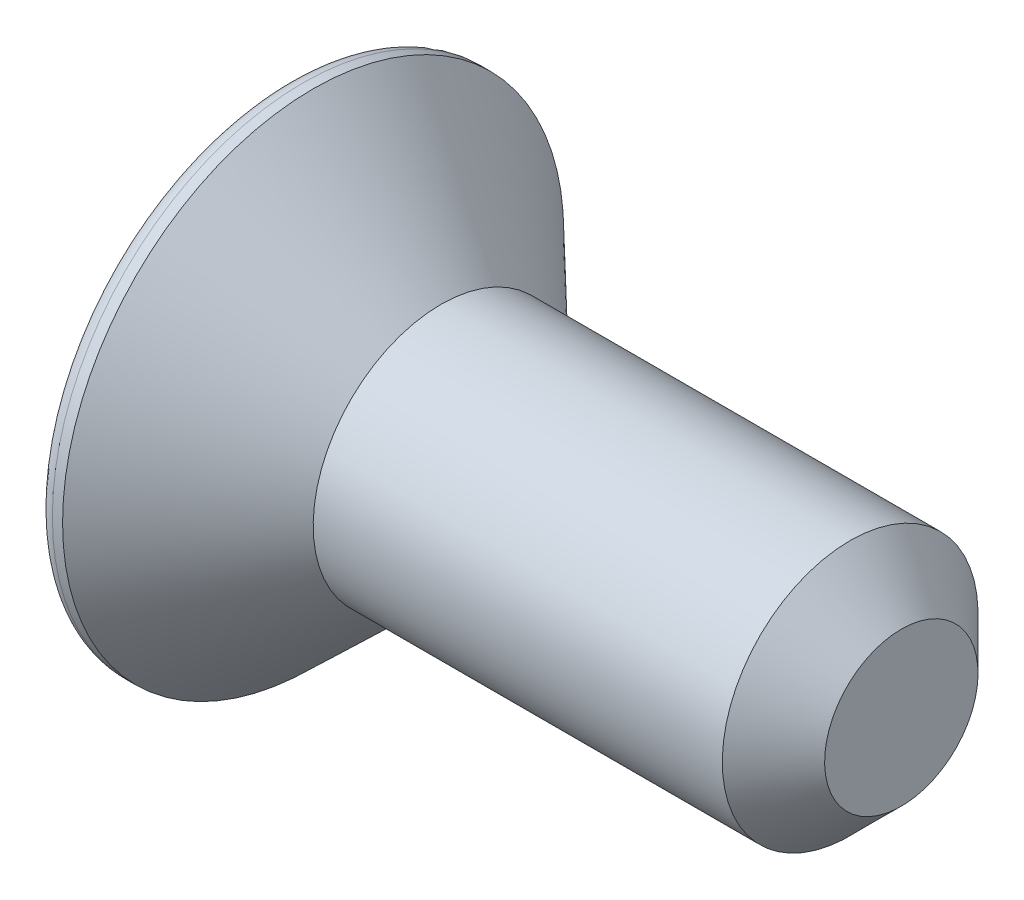
ISO-10303-21;
HEADER;
FILE_DESCRIPTION(('STEP AP214'),'2;1');
FILE_NAME('part.step','',(''),(''),'','','');
FILE_SCHEMA(('AUTOMOTIVE_DESIGN { 1 0 10303 214 1 1 1 1 }'));
ENDSEC;
DATA;
#1=APPLICATION_CONTEXT('core data for automotive mechanical design processes');
#2=APPLICATION_PROTOCOL_DEFINITION('international standard','automotive_design',2000,#1);
#3=PRODUCT_CONTEXT('',#1,'mechanical');
#4=PRODUCT('Part','Part','',(#3));
#5=PRODUCT_RELATED_PRODUCT_CATEGORY('part','',(#4));
#6=PRODUCT_DEFINITION_FORMATION('','',#4);
#7=PRODUCT_DEFINITION_CONTEXT('part definition',#1,'design');
#8=PRODUCT_DEFINITION('design','',#6,#7);
#9=PRODUCT_DEFINITION_SHAPE('','',#8);
#10=(LENGTH_UNIT() NAMED_UNIT(*) SI_UNIT(.MILLI.,.METRE.));
#11=(NAMED_UNIT(*) PLANE_ANGLE_UNIT() SI_UNIT($,.RADIAN.));
#12=(NAMED_UNIT(*) SI_UNIT($,.STERADIAN.) SOLID_ANGLE_UNIT());
#13=UNCERTAINTY_MEASURE_WITH_UNIT(LENGTH_MEASURE(1.E-05),#10,'distance_accuracy_value','');
#14=(GEOMETRIC_REPRESENTATION_CONTEXT(3) GLOBAL_UNCERTAINTY_ASSIGNED_CONTEXT((#13)) GLOBAL_UNIT_ASSIGNED_CONTEXT((#10,
#11,#12)) REPRESENTATION_CONTEXT('',''));
#15=CARTESIAN_POINT('',(0.,0.,0.));
#16=DIRECTION('',(0.,0.,1.));
#17=DIRECTION('',(1.,0.,0.));
#18=AXIS2_PLACEMENT_3D('',#15,#16,#17);
#19=CARTESIAN_POINT('',(0.,0.,0.));
#20=DIRECTION('',(-1.,0.,0.));
#21=DIRECTION('',(0.,-1.,0.));
#22=AXIS2_PLACEMENT_3D('',#19,#20,#21);
#23=PLANE('',#22);
#24=CARTESIAN_POINT('',(0.,0.,0.));
#25=DIRECTION('',(-1.,0.,0.));
#26=DIRECTION('',(0.,-1.,0.));
#27=AXIS2_PLACEMENT_3D('',#24,#25,#26);
#28=CIRCLE('',#27,4.6);
#29=CARTESIAN_POINT('',(0.,-4.6,0.));
#30=VERTEX_POINT('',#29);
#31=EDGE_CURVE('E156',#30,#30,#28,.T.);
#32=ORIENTED_EDGE('',*,*,#31,.T.);
#33=EDGE_LOOP('',(#32));
#34=FACE_BOUND('',#33,.T.);
#35=DIRECTION('',(0.,0.866025403784438,-0.5));
#36=VECTOR('',#35,1.);
#37=CARTESIAN_POINT('',(0.,0.,1.73205080756888));
#38=LINE('',#37,#36);
#39=CARTESIAN_POINT('',(0.,0.,1.73205080756888));
#40=VERTEX_POINT('',#39);
#41=CARTESIAN_POINT('',(0.,1.5,0.866025403784438));
#42=VERTEX_POINT('',#41);
#43=EDGE_CURVE('E55',#40,#42,#38,.T.);
#44=ORIENTED_EDGE('',*,*,#43,.F.);
#45=DIRECTION('',(0.,0.866025403784438,0.5));
#46=VECTOR('',#45,1.);
#47=CARTESIAN_POINT('',(0.,-1.5,0.866025403784439));
#48=LINE('',#47,#46);
#49=CARTESIAN_POINT('',(0.,-1.5,0.866025403784439));
#50=VERTEX_POINT('',#49);
#51=EDGE_CURVE('E138',#50,#40,#48,.T.);
#52=ORIENTED_EDGE('',*,*,#51,.F.);
#53=DIRECTION('',(0.,0.,1.));
#54=VECTOR('',#53,1.);
#55=CARTESIAN_POINT('',(0.,-1.5,-0.866025403784438));
#56=LINE('',#55,#54);
#57=CARTESIAN_POINT('',(0.,-1.5,-0.866025403784438));
#58=VERTEX_POINT('',#57);
#59=EDGE_CURVE('E136',#58,#50,#56,.T.);
#60=ORIENTED_EDGE('',*,*,#59,.F.);
#61=DIRECTION('',(0.,-0.866025403784439,0.5));
#62=VECTOR('',#61,1.);
#63=CARTESIAN_POINT('',(0.,0.,-1.73205080756888));
#64=LINE('',#63,#62);
#65=CARTESIAN_POINT('',(0.,0.,-1.73205080756888));
#66=VERTEX_POINT('',#65);
#67=EDGE_CURVE('E103',#66,#58,#64,.T.);
#68=ORIENTED_EDGE('',*,*,#67,.F.);
#69=DIRECTION('',(0.,-0.866025403784439,-0.5));
#70=VECTOR('',#69,1.);
#71=CARTESIAN_POINT('',(0.,1.5,-0.866025403784439));
#72=LINE('',#71,#70);
#73=CARTESIAN_POINT('',(0.,1.5,-0.866025403784439));
#74=VERTEX_POINT('',#73);
#75=EDGE_CURVE('E132',#74,#66,#72,.T.);
#76=ORIENTED_EDGE('',*,*,#75,.F.);
#77=DIRECTION('',(0.,0.,-1.));
#78=VECTOR('',#77,1.);
#79=CARTESIAN_POINT('',(0.,1.5,0.866025403784438));
#80=LINE('',#79,#78);
#81=EDGE_CURVE('E129',#42,#74,#80,.T.);
#82=ORIENTED_EDGE('',*,*,#81,.F.);
#83=EDGE_LOOP('',(#44,#52,#60,#68,#76,#82));
#84=FACE_BOUND('',#83,.T.);
#85=ADVANCED_FACE('F39',(#34,#84),#23,.T.);
#86=CARTESIAN_POINT('',(12.,0.,0.));
#87=DIRECTION('',(1.,0.,0.));
#88=DIRECTION('',(0.,1.,0.));
#89=AXIS2_PLACEMENT_3D('',#86,#87,#88);
#90=CYLINDRICAL_SURFACE('',#89,4.9);
#91=CARTESIAN_POINT('',(0.3,0.,0.));
#92=DIRECTION('',(-1.,0.,0.));
#93=DIRECTION('',(0.,-1.,0.));
#94=AXIS2_PLACEMENT_3D('',#91,#92,#93);
#95=CIRCLE('',#94,4.9);
#96=CARTESIAN_POINT('',(0.3,-4.9,0.));
#97=VERTEX_POINT('',#96);
#98=EDGE_CURVE('E153',#97,#97,#95,.F.);
#99=ORIENTED_EDGE('',*,*,#98,.T.);
#100=EDGE_LOOP('',(#99));
#101=FACE_BOUND('',#100,.T.);
#102=CARTESIAN_POINT('',(0.5,0.,0.));
#103=DIRECTION('',(1.,0.,0.));
#104=DIRECTION('',(0.,1.,0.));
#105=AXIS2_PLACEMENT_3D('',#102,#103,#104);
#106=CIRCLE('',#105,4.9);
#107=CARTESIAN_POINT('',(0.5,4.9,0.));
#108=VERTEX_POINT('',#107);
#109=EDGE_CURVE('E150',#108,#108,#106,.T.);
#110=ORIENTED_EDGE('',*,*,#109,.F.);
#111=EDGE_LOOP('',(#110));
#112=FACE_BOUND('',#111,.T.);
#113=ADVANCED_FACE('F172',(#101,#112),#90,.T.);
#114=CARTESIAN_POINT('',(3.,0.,0.));
#115=DIRECTION('',(-1.,0.,0.));
#116=DIRECTION('',(0.,-1.,0.));
#117=AXIS2_PLACEMENT_3D('',#114,#115,#116);
#118=CONICAL_SURFACE('',#117,2.5,0.76499283271091);
#119=ORIENTED_EDGE('',*,*,#109,.T.);
#120=EDGE_LOOP('',(#119));
#121=FACE_BOUND('',#120,.T.);
#122=CARTESIAN_POINT('',(3.,0.,0.));
#123=DIRECTION('',(1.,0.,0.));
#124=DIRECTION('',(0.,1.,0.));
#125=AXIS2_PLACEMENT_3D('',#122,#123,#124);
#126=CIRCLE('',#125,2.5);
#127=CARTESIAN_POINT('',(3.,2.5,0.));
#128=VERTEX_POINT('',#127);
#129=EDGE_CURVE('E142',#128,#128,#126,.T.);
#130=ORIENTED_EDGE('',*,*,#129,.F.);
#131=EDGE_LOOP('',(#130));
#132=FACE_BOUND('',#131,.T.);
#133=ADVANCED_FACE('F178',(#121,#132),#118,.T.);
#134=CARTESIAN_POINT('',(12.,0.,0.));
#135=DIRECTION('',(1.,0.,0.));
#136=DIRECTION('',(0.,1.,0.));
#137=AXIS2_PLACEMENT_3D('',#134,#135,#136);
#138=CYLINDRICAL_SURFACE('',#137,2.5);
#139=CARTESIAN_POINT('',(11.,0.,0.));
#140=DIRECTION('',(1.,0.,0.));
#141=DIRECTION('',(0.,1.,0.));
#142=AXIS2_PLACEMENT_3D('',#139,#140,#141);
#143=CIRCLE('',#142,2.5);
#144=CARTESIAN_POINT('',(11.,2.5,0.));
#145=VERTEX_POINT('',#144);
#146=EDGE_CURVE('E11',#145,#145,#143,.F.);
#147=ORIENTED_EDGE('',*,*,#146,.T.);
#148=EDGE_LOOP('',(#147));
#149=FACE_BOUND('',#148,.T.);
#150=ORIENTED_EDGE('',*,*,#129,.T.);
#151=EDGE_LOOP('',(#150));
#152=FACE_BOUND('',#151,.T.);
#153=ADVANCED_FACE('F185',(#149,#152),#138,.T.);
#154=CARTESIAN_POINT('',(12.,2.5,0.));
#155=DIRECTION('',(1.,0.,0.));
#156=DIRECTION('',(0.,1.,0.));
#157=AXIS2_PLACEMENT_3D('',#154,#155,#156);
#158=PLANE('',#157);
#159=CARTESIAN_POINT('',(12.,0.,0.));
#160=DIRECTION('',(1.,0.,0.));
#161=DIRECTION('',(0.,1.,0.));
#162=AXIS2_PLACEMENT_3D('',#159,#160,#161);
#163=CIRCLE('',#162,1.5);
#164=CARTESIAN_POINT('',(12.,1.5,0.));
#165=VERTEX_POINT('',#164);
#166=EDGE_CURVE('E48',#165,#165,#163,.T.);
#167=ORIENTED_EDGE('',*,*,#166,.T.);
#168=EDGE_LOOP('',(#167));
#169=FACE_BOUND('',#168,.T.);
#170=ADVANCED_FACE('F161',(#169),#158,.T.);
#171=CARTESIAN_POINT('',(2.,0.,1.73205080756888));
#172=DIRECTION('',(0.,0.5,0.866025403784439));
#173=DIRECTION('',(0.,-0.866025403784438,0.5));
#174=AXIS2_PLACEMENT_3D('',#171,#172,#173);
#175=PLANE('',#174);
#176=ORIENTED_EDGE('',*,*,#43,.T.);
#177=DIRECTION('',(-1.,0.,0.));
#178=VECTOR('',#177,1.);
#179=CARTESIAN_POINT('',(2.,1.5,0.866025403784438));
#180=LINE('',#179,#178);
#181=CARTESIAN_POINT('',(2.,1.5,0.866025403784438));
#182=VERTEX_POINT('',#181);
#183=EDGE_CURVE('E85',#182,#42,#180,.T.);
#184=ORIENTED_EDGE('',*,*,#183,.F.);
#185=DIRECTION('',(0.,0.866025403784438,-0.5));
#186=VECTOR('',#185,1.);
#187=CARTESIAN_POINT('',(2.,0.,1.73205080756888));
#188=LINE('',#187,#186);
#189=CARTESIAN_POINT('',(2.,0.,1.73205080756888));
#190=VERTEX_POINT('',#189);
#191=EDGE_CURVE('E140',#190,#182,#188,.T.);
#192=ORIENTED_EDGE('',*,*,#191,.F.);
#193=DIRECTION('',(-1.,0.,0.));
#194=VECTOR('',#193,1.);
#195=CARTESIAN_POINT('',(2.,0.,1.73205080756888));
#196=LINE('',#195,#194);
#197=EDGE_CURVE('E63',#190,#40,#196,.T.);
#198=ORIENTED_EDGE('',*,*,#197,.T.);
#199=EDGE_LOOP('',(#176,#184,#192,#198));
#200=FACE_BOUND('',#199,.T.);
#201=ADVANCED_FACE('F192',(#200),#175,.F.);
#202=CARTESIAN_POINT('',(2.,-1.5,0.866025403784439));
#203=DIRECTION('',(0.,-0.5,0.866025403784438));
#204=DIRECTION('',(0.,-0.866025403784439,-0.5));
#205=AXIS2_PLACEMENT_3D('',#202,#203,#204);
#206=PLANE('',#205);
#207=ORIENTED_EDGE('',*,*,#51,.T.);
#208=ORIENTED_EDGE('',*,*,#197,.F.);
#209=DIRECTION('',(0.,0.866025403784438,0.5));
#210=VECTOR('',#209,1.);
#211=CARTESIAN_POINT('',(2.,-1.5,0.866025403784439));
#212=LINE('',#211,#210);
#213=CARTESIAN_POINT('',(2.,-1.5,0.866025403784439));
#214=VERTEX_POINT('',#213);
#215=EDGE_CURVE('E115',#214,#190,#212,.T.);
#216=ORIENTED_EDGE('',*,*,#215,.F.);
#217=DIRECTION('',(-1.,0.,0.));
#218=VECTOR('',#217,1.);
#219=CARTESIAN_POINT('',(2.,-1.5,0.866025403784439));
#220=LINE('',#219,#218);
#221=EDGE_CURVE('E107',#214,#50,#220,.T.);
#222=ORIENTED_EDGE('',*,*,#221,.T.);
#223=EDGE_LOOP('',(#207,#208,#216,#222));
#224=FACE_BOUND('',#223,.T.);
#225=ADVANCED_FACE('F195',(#224),#206,.F.);
#226=CARTESIAN_POINT('',(2.,-1.5,-0.866025403784438));
#227=DIRECTION('',(0.,-1.,0.));
#228=DIRECTION('',(0.,0.,-1.));
#229=AXIS2_PLACEMENT_3D('',#226,#227,#228);
#230=PLANE('',#229);
#231=ORIENTED_EDGE('',*,*,#59,.T.);
#232=ORIENTED_EDGE('',*,*,#221,.F.);
#233=DIRECTION('',(0.,0.,1.));
#234=VECTOR('',#233,1.);
#235=CARTESIAN_POINT('',(2.,-1.5,-0.866025403784438));
#236=LINE('',#235,#234);
#237=CARTESIAN_POINT('',(2.,-1.5,-0.866025403784438));
#238=VERTEX_POINT('',#237);
#239=EDGE_CURVE('E111',#238,#214,#236,.T.);
#240=ORIENTED_EDGE('',*,*,#239,.F.);
#241=DIRECTION('',(-1.,0.,0.));
#242=VECTOR('',#241,1.);
#243=CARTESIAN_POINT('',(2.,-1.5,-0.866025403784438));
#244=LINE('',#243,#242);
#245=EDGE_CURVE('E96',#238,#58,#244,.T.);
#246=ORIENTED_EDGE('',*,*,#245,.T.);
#247=EDGE_LOOP('',(#231,#232,#240,#246));
#248=FACE_BOUND('',#247,.T.);
#249=ADVANCED_FACE('F112',(#248),#230,.F.);
#250=CARTESIAN_POINT('',(2.,0.,-1.73205080756888));
#251=DIRECTION('',(0.,-0.5,-0.866025403784439));
#252=DIRECTION('',(0.,0.866025403784439,-0.5));
#253=AXIS2_PLACEMENT_3D('',#250,#251,#252);
#254=PLANE('',#253);
#255=ORIENTED_EDGE('',*,*,#67,.T.);
#256=ORIENTED_EDGE('',*,*,#245,.F.);
#257=DIRECTION('',(0.,-0.866025403784439,0.5));
#258=VECTOR('',#257,1.);
#259=CARTESIAN_POINT('',(2.,0.,-1.73205080756888));
#260=LINE('',#259,#258);
#261=CARTESIAN_POINT('',(2.,0.,-1.73205080756888));
#262=VERTEX_POINT('',#261);
#263=EDGE_CURVE('E100',#262,#238,#260,.T.);
#264=ORIENTED_EDGE('',*,*,#263,.F.);
#265=DIRECTION('',(-1.,0.,0.));
#266=VECTOR('',#265,1.);
#267=CARTESIAN_POINT('',(2.,0.,-1.73205080756888));
#268=LINE('',#267,#266);
#269=EDGE_CURVE('E108',#262,#66,#268,.T.);
#270=ORIENTED_EDGE('',*,*,#269,.T.);
#271=EDGE_LOOP('',(#255,#256,#264,#270));
#272=FACE_BOUND('',#271,.T.);
#273=ADVANCED_FACE('F98',(#272),#254,.F.);
#274=CARTESIAN_POINT('',(2.,1.5,-0.866025403784439));
#275=DIRECTION('',(0.,0.5,-0.866025403784439));
#276=DIRECTION('',(0.,0.866025403784439,0.5));
#277=AXIS2_PLACEMENT_3D('',#274,#275,#276);
#278=PLANE('',#277);
#279=ORIENTED_EDGE('',*,*,#75,.T.);
#280=ORIENTED_EDGE('',*,*,#269,.F.);
#281=DIRECTION('',(0.,-0.866025403784439,-0.5));
#282=VECTOR('',#281,1.);
#283=CARTESIAN_POINT('',(2.,1.5,-0.866025403784439));
#284=LINE('',#283,#282);
#285=CARTESIAN_POINT('',(2.,1.5,-0.866025403784439));
#286=VERTEX_POINT('',#285);
#287=EDGE_CURVE('E121',#286,#262,#284,.T.);
#288=ORIENTED_EDGE('',*,*,#287,.F.);
#289=DIRECTION('',(-1.,0.,0.));
#290=VECTOR('',#289,1.);
#291=CARTESIAN_POINT('',(2.,1.5,-0.866025403784439));
#292=LINE('',#291,#290);
#293=EDGE_CURVE('E145',#286,#74,#292,.T.);
#294=ORIENTED_EDGE('',*,*,#293,.T.);
#295=EDGE_LOOP('',(#279,#280,#288,#294));
#296=FACE_BOUND('',#295,.T.);
#297=ADVANCED_FACE('F199',(#296),#278,.F.);
#298=CARTESIAN_POINT('',(2.,1.5,0.866025403784438));
#299=DIRECTION('',(0.,1.,0.));
#300=DIRECTION('',(0.,0.,1.));
#301=AXIS2_PLACEMENT_3D('',#298,#299,#300);
#302=PLANE('',#301);
#303=ORIENTED_EDGE('',*,*,#81,.T.);
#304=ORIENTED_EDGE('',*,*,#293,.F.);
#305=DIRECTION('',(0.,0.,-1.));
#306=VECTOR('',#305,1.);
#307=CARTESIAN_POINT('',(2.,1.5,0.866025403784438));
#308=LINE('',#307,#306);
#309=EDGE_CURVE('E123',#182,#286,#308,.T.);
#310=ORIENTED_EDGE('',*,*,#309,.F.);
#311=ORIENTED_EDGE('',*,*,#183,.T.);
#312=EDGE_LOOP('',(#303,#304,#310,#311));
#313=FACE_BOUND('',#312,.T.);
#314=ADVANCED_FACE('F196',(#313),#302,.F.);
#315=CARTESIAN_POINT('',(2.,0.,0.));
#316=DIRECTION('',(-1.,0.,0.));
#317=DIRECTION('',(0.,0.,1.));
#318=AXIS2_PLACEMENT_3D('',#315,#316,#317);
#319=PLANE('',#318);
#320=ORIENTED_EDGE('',*,*,#191,.T.);
#321=ORIENTED_EDGE('',*,*,#309,.T.);
#322=ORIENTED_EDGE('',*,*,#287,.T.);
#323=ORIENTED_EDGE('',*,*,#263,.T.);
#324=ORIENTED_EDGE('',*,*,#239,.T.);
#325=ORIENTED_EDGE('',*,*,#215,.T.);
#326=EDGE_LOOP('',(#320,#321,#322,#323,#324,#325));
#327=FACE_BOUND('',#326,.T.);
#328=ADVANCED_FACE('F118',(#327),#319,.T.);
#329=CARTESIAN_POINT('',(0.3,0.,0.));
#330=DIRECTION('',(-1.,0.,0.));
#331=DIRECTION('',(0.,-1.,0.));
#332=AXIS2_PLACEMENT_3D('',#329,#330,#331);
#333=TOROIDAL_SURFACE('',#332,4.6,0.3);
#334=ORIENTED_EDGE('',*,*,#31,.F.);
#335=EDGE_LOOP('',(#334));
#336=FACE_BOUND('',#335,.T.);
#337=ORIENTED_EDGE('',*,*,#98,.F.);
#338=EDGE_LOOP('',(#337));
#339=FACE_BOUND('',#338,.T.);
#340=ADVANCED_FACE('F164',(#336,#339),#333,.T.);
#341=CARTESIAN_POINT('',(12.,0.,0.));
#342=DIRECTION('',(-1.,0.,0.));
#343=DIRECTION('',(0.,-1.,0.));
#344=AXIS2_PLACEMENT_3D('',#341,#342,#343);
#345=CONICAL_SURFACE('',#344,1.5,0.785398163397446);
#346=ORIENTED_EDGE('',*,*,#146,.F.);
#347=EDGE_LOOP('',(#346));
#348=FACE_BOUND('',#347,.T.);
#349=ORIENTED_EDGE('',*,*,#166,.F.);
#350=EDGE_LOOP('',(#349));
#351=FACE_BOUND('',#350,.T.);
#352=ADVANCED_FACE('F42',(#348,#351),#345,.T.);
#353=CLOSED_SHELL('',(#85,#113,#133,#153,#170,#201,#225,#249,#273,#297,#314,#328,#340,#352));
#354=MANIFOLD_SOLID_BREP('B2',#353);
#355=ADVANCED_BREP_SHAPE_REPRESENTATION('',(#18,#354),#14);
#356=SHAPE_DEFINITION_REPRESENTATION(#9,#355);
ENDSEC;
END-ISO-10303-21;
